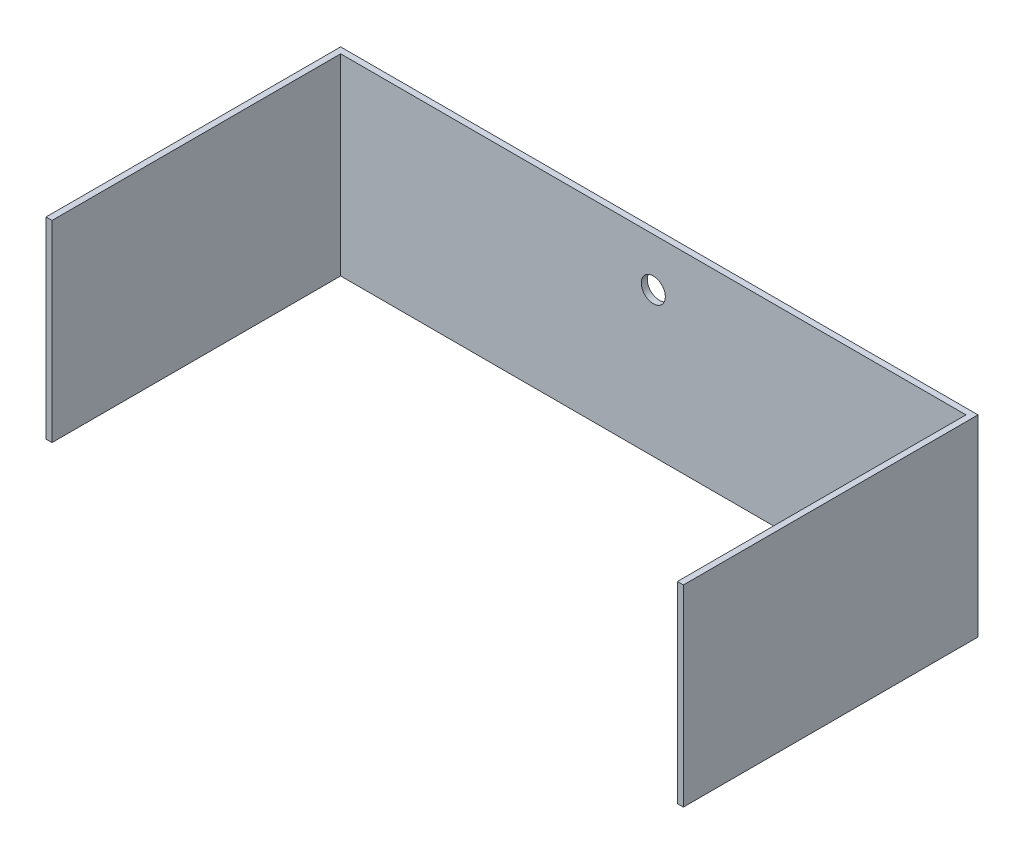
ISO-10303-21;
HEADER;
FILE_DESCRIPTION(('STEP AP214'),'2;1');
FILE_NAME('part.step','',(''),(''),'','','');
FILE_SCHEMA(('AUTOMOTIVE_DESIGN { 1 0 10303 214 1 1 1 1 }'));
ENDSEC;
DATA;
#1=APPLICATION_CONTEXT('core data for automotive mechanical design processes');
#2=APPLICATION_PROTOCOL_DEFINITION('international standard','automotive_design',2000,#1);
#3=PRODUCT_CONTEXT('',#1,'mechanical');
#4=PRODUCT('Part','Part','',(#3));
#5=PRODUCT_RELATED_PRODUCT_CATEGORY('part','',(#4));
#6=PRODUCT_DEFINITION_FORMATION('','',#4);
#7=PRODUCT_DEFINITION_CONTEXT('part definition',#1,'design');
#8=PRODUCT_DEFINITION('design','',#6,#7);
#9=PRODUCT_DEFINITION_SHAPE('','',#8);
#10=(LENGTH_UNIT() NAMED_UNIT(*) SI_UNIT(.MILLI.,.METRE.));
#11=(NAMED_UNIT(*) PLANE_ANGLE_UNIT() SI_UNIT($,.RADIAN.));
#12=(NAMED_UNIT(*) SI_UNIT($,.STERADIAN.) SOLID_ANGLE_UNIT());
#13=UNCERTAINTY_MEASURE_WITH_UNIT(LENGTH_MEASURE(1.E-05),#10,'distance_accuracy_value','');
#14=(GEOMETRIC_REPRESENTATION_CONTEXT(3) GLOBAL_UNCERTAINTY_ASSIGNED_CONTEXT((#13)) GLOBAL_UNIT_ASSIGNED_CONTEXT((#10,
#11,#12)) REPRESENTATION_CONTEXT('',''));
#15=CARTESIAN_POINT('',(0.,0.,0.));
#16=DIRECTION('',(0.,0.,1.));
#17=DIRECTION('',(1.,0.,0.));
#18=AXIS2_PLACEMENT_3D('',#15,#16,#17);
#19=CARTESIAN_POINT('',(0.,101.6,0.));
#20=DIRECTION('',(0.,0.,-1.));
#21=DIRECTION('',(-1.,0.,0.));
#22=AXIS2_PLACEMENT_3D('',#19,#20,#21);
#23=PLANE('',#22);
#24=DIRECTION('',(1.,0.,0.));
#25=VECTOR('',#24,1.);
#26=CARTESIAN_POINT('',(0.,0.,0.));
#27=LINE('',#26,#25);
#28=CARTESIAN_POINT('',(-3.175,0.,0.));
#29=VERTEX_POINT('',#28);
#30=CARTESIAN_POINT('',(0.,0.,0.));
#31=VERTEX_POINT('',#30);
#32=EDGE_CURVE('E128',#29,#31,#27,.T.);
#33=ORIENTED_EDGE('',*,*,#32,.T.);
#34=DIRECTION('',(0.,-1.,0.));
#35=VECTOR('',#34,1.);
#36=CARTESIAN_POINT('',(0.,101.6,0.));
#37=LINE('',#36,#35);
#38=CARTESIAN_POINT('',(0.,101.6,0.));
#39=VERTEX_POINT('',#38);
#40=EDGE_CURVE('E11',#39,#31,#37,.T.);
#41=ORIENTED_EDGE('',*,*,#40,.F.);
#42=DIRECTION('',(1.,0.,0.));
#43=VECTOR('',#42,1.);
#44=CARTESIAN_POINT('',(0.,101.6,0.));
#45=LINE('',#44,#43);
#46=CARTESIAN_POINT('',(-3.175,101.6,0.));
#47=VERTEX_POINT('',#46);
#48=EDGE_CURVE('E143',#47,#39,#45,.T.);
#49=ORIENTED_EDGE('',*,*,#48,.F.);
#50=DIRECTION('',(0.,-1.,0.));
#51=VECTOR('',#50,1.);
#52=CARTESIAN_POINT('',(-3.175,101.6,0.));
#53=LINE('',#52,#51);
#54=EDGE_CURVE('E124',#47,#29,#53,.T.);
#55=ORIENTED_EDGE('',*,*,#54,.T.);
#56=EDGE_LOOP('',(#33,#41,#49,#55));
#57=FACE_BOUND('',#56,.T.);
#58=ADVANCED_FACE('F32',(#57),#23,.F.);
#59=CARTESIAN_POINT('',(0.,101.6,0.));
#60=DIRECTION('',(-1.,0.,0.));
#61=DIRECTION('',(0.,0.,1.));
#62=AXIS2_PLACEMENT_3D('',#59,#60,#61);
#63=PLANE('',#62);
#64=DIRECTION('',(0.,0.,-1.));
#65=VECTOR('',#64,1.);
#66=CARTESIAN_POINT('',(0.,0.,0.));
#67=LINE('',#66,#65);
#68=CARTESIAN_POINT('',(0.,0.,-152.4));
#69=VERTEX_POINT('',#68);
#70=EDGE_CURVE('E131',#31,#69,#67,.T.);
#71=ORIENTED_EDGE('',*,*,#70,.T.);
#72=DIRECTION('',(0.,-1.,0.));
#73=VECTOR('',#72,1.);
#74=CARTESIAN_POINT('',(0.,101.6,-152.4));
#75=LINE('',#74,#73);
#76=CARTESIAN_POINT('',(0.,101.6,-152.4));
#77=VERTEX_POINT('',#76);
#78=EDGE_CURVE('E40',#77,#69,#75,.T.);
#79=ORIENTED_EDGE('',*,*,#78,.F.);
#80=DIRECTION('',(0.,0.,-1.));
#81=VECTOR('',#80,1.);
#82=CARTESIAN_POINT('',(0.,101.6,0.));
#83=LINE('',#82,#81);
#84=EDGE_CURVE('E91',#39,#77,#83,.T.);
#85=ORIENTED_EDGE('',*,*,#84,.F.);
#86=ORIENTED_EDGE('',*,*,#40,.T.);
#87=EDGE_LOOP('',(#71,#79,#85,#86));
#88=FACE_BOUND('',#87,.T.);
#89=ADVANCED_FACE('F195',(#88),#63,.F.);
#90=CARTESIAN_POINT('',(0.,101.6,-152.4));
#91=DIRECTION('',(0.,0.,-1.));
#92=DIRECTION('',(-1.,0.,0.));
#93=AXIS2_PLACEMENT_3D('',#90,#91,#92);
#94=PLANE('',#93);
#95=CARTESIAN_POINT('',(165.1,76.2,-152.4));
#96=DIRECTION('',(0.,0.,-1.));
#97=DIRECTION('',(-1.,0.,0.));
#98=AXIS2_PLACEMENT_3D('',#95,#96,#97);
#99=CIRCLE('',#98,6.35000000000002);
#100=CARTESIAN_POINT('',(158.75,76.2,-152.4));
#101=VERTEX_POINT('',#100);
#102=EDGE_CURVE('E132',#101,#101,#99,.F.);
#103=ORIENTED_EDGE('',*,*,#102,.F.);
#104=EDGE_LOOP('',(#103));
#105=FACE_BOUND('',#104,.T.);
#106=DIRECTION('',(1.,0.,0.));
#107=VECTOR('',#106,1.);
#108=CARTESIAN_POINT('',(0.,0.,-152.4));
#109=LINE('',#108,#107);
#110=CARTESIAN_POINT('',(330.2,0.,-152.4));
#111=VERTEX_POINT('',#110);
#112=EDGE_CURVE('E134',#69,#111,#109,.T.);
#113=ORIENTED_EDGE('',*,*,#112,.T.);
#114=DIRECTION('',(0.,-1.,0.));
#115=VECTOR('',#114,1.);
#116=CARTESIAN_POINT('',(330.2,101.6,-152.4));
#117=LINE('',#116,#115);
#118=CARTESIAN_POINT('',(330.2,101.6,-152.4));
#119=VERTEX_POINT('',#118);
#120=EDGE_CURVE('E150',#119,#111,#117,.T.);
#121=ORIENTED_EDGE('',*,*,#120,.F.);
#122=DIRECTION('',(1.,0.,0.));
#123=VECTOR('',#122,1.);
#124=CARTESIAN_POINT('',(0.,101.6,-152.4));
#125=LINE('',#124,#123);
#126=EDGE_CURVE('E158',#77,#119,#125,.T.);
#127=ORIENTED_EDGE('',*,*,#126,.F.);
#128=ORIENTED_EDGE('',*,*,#78,.T.);
#129=EDGE_LOOP('',(#113,#121,#127,#128));
#130=FACE_BOUND('',#129,.T.);
#131=ADVANCED_FACE('F156',(#105,#130),#94,.F.);
#132=CARTESIAN_POINT('',(330.2,101.6,-152.4));
#133=DIRECTION('',(1.,0.,0.));
#134=DIRECTION('',(0.,0.,-1.));
#135=AXIS2_PLACEMENT_3D('',#132,#133,#134);
#136=PLANE('',#135);
#137=DIRECTION('',(0.,0.,1.));
#138=VECTOR('',#137,1.);
#139=CARTESIAN_POINT('',(330.2,0.,-152.4));
#140=LINE('',#139,#138);
#141=CARTESIAN_POINT('',(330.2,0.,0.));
#142=VERTEX_POINT('',#141);
#143=EDGE_CURVE('E136',#111,#142,#140,.T.);
#144=ORIENTED_EDGE('',*,*,#143,.T.);
#145=DIRECTION('',(0.,-1.,0.));
#146=VECTOR('',#145,1.);
#147=CARTESIAN_POINT('',(330.2,101.6,0.));
#148=LINE('',#147,#146);
#149=CARTESIAN_POINT('',(330.2,101.6,0.));
#150=VERTEX_POINT('',#149);
#151=EDGE_CURVE('E147',#150,#142,#148,.T.);
#152=ORIENTED_EDGE('',*,*,#151,.F.);
#153=DIRECTION('',(0.,0.,1.));
#154=VECTOR('',#153,1.);
#155=CARTESIAN_POINT('',(330.2,101.6,-152.4));
#156=LINE('',#155,#154);
#157=EDGE_CURVE('E170',#119,#150,#156,.T.);
#158=ORIENTED_EDGE('',*,*,#157,.F.);
#159=ORIENTED_EDGE('',*,*,#120,.T.);
#160=EDGE_LOOP('',(#144,#152,#158,#159));
#161=FACE_BOUND('',#160,.T.);
#162=ADVANCED_FACE('F166',(#161),#136,.F.);
#163=CARTESIAN_POINT('',(330.2,101.6,0.));
#164=DIRECTION('',(0.,0.,-1.));
#165=DIRECTION('',(-1.,0.,0.));
#166=AXIS2_PLACEMENT_3D('',#163,#164,#165);
#167=PLANE('',#166);
#168=DIRECTION('',(1.,0.,0.));
#169=VECTOR('',#168,1.);
#170=CARTESIAN_POINT('',(330.2,0.,0.));
#171=LINE('',#170,#169);
#172=CARTESIAN_POINT('',(333.375,0.,0.));
#173=VERTEX_POINT('',#172);
#174=EDGE_CURVE('E138',#142,#173,#171,.T.);
#175=ORIENTED_EDGE('',*,*,#174,.T.);
#176=DIRECTION('',(0.,-1.,0.));
#177=VECTOR('',#176,1.);
#178=CARTESIAN_POINT('',(333.375,101.6,0.));
#179=LINE('',#178,#177);
#180=CARTESIAN_POINT('',(333.375,101.6,0.));
#181=VERTEX_POINT('',#180);
#182=EDGE_CURVE('E119',#181,#173,#179,.T.);
#183=ORIENTED_EDGE('',*,*,#182,.F.);
#184=DIRECTION('',(1.,0.,0.));
#185=VECTOR('',#184,1.);
#186=CARTESIAN_POINT('',(330.2,101.6,0.));
#187=LINE('',#186,#185);
#188=EDGE_CURVE('E110',#150,#181,#187,.T.);
#189=ORIENTED_EDGE('',*,*,#188,.F.);
#190=ORIENTED_EDGE('',*,*,#151,.T.);
#191=EDGE_LOOP('',(#175,#183,#189,#190));
#192=FACE_BOUND('',#191,.T.);
#193=ADVANCED_FACE('F169',(#192),#167,.F.);
#194=CARTESIAN_POINT('',(333.375,101.6,0.));
#195=DIRECTION('',(-1.,0.,0.));
#196=DIRECTION('',(0.,0.,1.));
#197=AXIS2_PLACEMENT_3D('',#194,#195,#196);
#198=PLANE('',#197);
#199=DIRECTION('',(0.,0.,-1.));
#200=VECTOR('',#199,1.);
#201=CARTESIAN_POINT('',(333.375,0.,0.));
#202=LINE('',#201,#200);
#203=CARTESIAN_POINT('',(333.375,0.,-155.575));
#204=VERTEX_POINT('',#203);
#205=EDGE_CURVE('E118',#173,#204,#202,.T.);
#206=ORIENTED_EDGE('',*,*,#205,.T.);
#207=DIRECTION('',(0.,-1.,0.));
#208=VECTOR('',#207,1.);
#209=CARTESIAN_POINT('',(333.375,101.6,-155.575));
#210=LINE('',#209,#208);
#211=CARTESIAN_POINT('',(333.375,101.6,-155.575));
#212=VERTEX_POINT('',#211);
#213=EDGE_CURVE('E115',#212,#204,#210,.T.);
#214=ORIENTED_EDGE('',*,*,#213,.F.);
#215=DIRECTION('',(0.,0.,-1.));
#216=VECTOR('',#215,1.);
#217=CARTESIAN_POINT('',(333.375,101.6,0.));
#218=LINE('',#217,#216);
#219=EDGE_CURVE('E104',#181,#212,#218,.T.);
#220=ORIENTED_EDGE('',*,*,#219,.F.);
#221=ORIENTED_EDGE('',*,*,#182,.T.);
#222=EDGE_LOOP('',(#206,#214,#220,#221));
#223=FACE_BOUND('',#222,.T.);
#224=ADVANCED_FACE('F116',(#223),#198,.F.);
#225=CARTESIAN_POINT('',(-3.175,101.6,-155.575));
#226=DIRECTION('',(0.,0.,1.));
#227=DIRECTION('',(1.,0.,0.));
#228=AXIS2_PLACEMENT_3D('',#225,#226,#227);
#229=PLANE('',#228);
#230=CARTESIAN_POINT('',(165.1,76.2,-155.575));
#231=DIRECTION('',(0.,0.,-1.));
#232=DIRECTION('',(-1.,0.,0.));
#233=AXIS2_PLACEMENT_3D('',#230,#231,#232);
#234=CIRCLE('',#233,6.35000000000002);
#235=CARTESIAN_POINT('',(158.75,76.2,-155.575));
#236=VERTEX_POINT('',#235);
#237=EDGE_CURVE('E178',#236,#236,#234,.T.);
#238=ORIENTED_EDGE('',*,*,#237,.F.);
#239=EDGE_LOOP('',(#238));
#240=FACE_BOUND('',#239,.T.);
#241=DIRECTION('',(-1.,0.,0.));
#242=VECTOR('',#241,1.);
#243=CARTESIAN_POINT('',(-3.175,0.,-155.575));
#244=LINE('',#243,#242);
#245=CARTESIAN_POINT('',(-3.175,0.,-155.575));
#246=VERTEX_POINT('',#245);
#247=EDGE_CURVE('E77',#204,#246,#244,.T.);
#248=ORIENTED_EDGE('',*,*,#247,.T.);
#249=DIRECTION('',(0.,-1.,0.));
#250=VECTOR('',#249,1.);
#251=CARTESIAN_POINT('',(-3.175,101.6,-155.575));
#252=LINE('',#251,#250);
#253=CARTESIAN_POINT('',(-3.175,101.6,-155.575));
#254=VERTEX_POINT('',#253);
#255=EDGE_CURVE('E120',#254,#246,#252,.T.);
#256=ORIENTED_EDGE('',*,*,#255,.F.);
#257=DIRECTION('',(-1.,0.,0.));
#258=VECTOR('',#257,1.);
#259=CARTESIAN_POINT('',(-3.175,101.6,-155.575));
#260=LINE('',#259,#258);
#261=EDGE_CURVE('E108',#212,#254,#260,.T.);
#262=ORIENTED_EDGE('',*,*,#261,.F.);
#263=ORIENTED_EDGE('',*,*,#213,.T.);
#264=EDGE_LOOP('',(#248,#256,#262,#263));
#265=FACE_BOUND('',#264,.T.);
#266=ADVANCED_FACE('F122',(#240,#265),#229,.F.);
#267=CARTESIAN_POINT('',(-3.175,101.6,0.));
#268=DIRECTION('',(1.,0.,0.));
#269=DIRECTION('',(0.,0.,-1.));
#270=AXIS2_PLACEMENT_3D('',#267,#268,#269);
#271=PLANE('',#270);
#272=DIRECTION('',(0.,0.,1.));
#273=VECTOR('',#272,1.);
#274=CARTESIAN_POINT('',(-3.175,0.,0.));
#275=LINE('',#274,#273);
#276=EDGE_CURVE('E83',#246,#29,#275,.T.);
#277=ORIENTED_EDGE('',*,*,#276,.T.);
#278=ORIENTED_EDGE('',*,*,#54,.F.);
#279=DIRECTION('',(0.,0.,1.));
#280=VECTOR('',#279,1.);
#281=CARTESIAN_POINT('',(-3.175,101.6,0.));
#282=LINE('',#281,#280);
#283=EDGE_CURVE('E48',#254,#47,#282,.T.);
#284=ORIENTED_EDGE('',*,*,#283,.F.);
#285=ORIENTED_EDGE('',*,*,#255,.T.);
#286=EDGE_LOOP('',(#277,#278,#284,#285));
#287=FACE_BOUND('',#286,.T.);
#288=ADVANCED_FACE('F186',(#287),#271,.F.);
#289=CARTESIAN_POINT('',(0.,101.6,0.));
#290=DIRECTION('',(0.,-1.,0.));
#291=DIRECTION('',(0.,0.,-1.));
#292=AXIS2_PLACEMENT_3D('',#289,#290,#291);
#293=PLANE('',#292);
#294=ORIENTED_EDGE('',*,*,#48,.T.);
#295=ORIENTED_EDGE('',*,*,#84,.T.);
#296=ORIENTED_EDGE('',*,*,#126,.T.);
#297=ORIENTED_EDGE('',*,*,#157,.T.);
#298=ORIENTED_EDGE('',*,*,#188,.T.);
#299=ORIENTED_EDGE('',*,*,#219,.T.);
#300=ORIENTED_EDGE('',*,*,#261,.T.);
#301=ORIENTED_EDGE('',*,*,#283,.T.);
#302=EDGE_LOOP('',(#294,#295,#296,#297,#298,#299,#300,#301));
#303=FACE_BOUND('',#302,.T.);
#304=ADVANCED_FACE('F106',(#303),#293,.F.);
#305=CARTESIAN_POINT('',(0.,0.,0.));
#306=DIRECTION('',(0.,-1.,0.));
#307=DIRECTION('',(0.,0.,-1.));
#308=AXIS2_PLACEMENT_3D('',#305,#306,#307);
#309=PLANE('',#308);
#310=ORIENTED_EDGE('',*,*,#32,.F.);
#311=ORIENTED_EDGE('',*,*,#276,.F.);
#312=ORIENTED_EDGE('',*,*,#247,.F.);
#313=ORIENTED_EDGE('',*,*,#205,.F.);
#314=ORIENTED_EDGE('',*,*,#174,.F.);
#315=ORIENTED_EDGE('',*,*,#143,.F.);
#316=ORIENTED_EDGE('',*,*,#112,.F.);
#317=ORIENTED_EDGE('',*,*,#70,.F.);
#318=EDGE_LOOP('',(#310,#311,#312,#313,#314,#315,#316,#317));
#319=FACE_BOUND('',#318,.T.);
#320=ADVANCED_FACE('F162',(#319),#309,.T.);
#321=CARTESIAN_POINT('',(165.1,76.2,0.001000000000001));
#322=DIRECTION('',(0.,0.,-1.));
#323=DIRECTION('',(-1.,0.,0.));
#324=AXIS2_PLACEMENT_3D('',#321,#322,#323);
#325=CYLINDRICAL_SURFACE('',#324,6.35000000000002);
#326=ORIENTED_EDGE('',*,*,#237,.T.);
#327=EDGE_LOOP('',(#326));
#328=FACE_BOUND('',#327,.T.);
#329=ORIENTED_EDGE('',*,*,#102,.T.);
#330=EDGE_LOOP('',(#329));
#331=FACE_BOUND('',#330,.T.);
#332=ADVANCED_FACE('F182',(#328,#331),#325,.F.);
#333=CLOSED_SHELL('',(#58,#89,#131,#162,#193,#224,#266,#288,#304,#320,#332));
#334=MANIFOLD_SOLID_BREP('B2',#333);
#335=ADVANCED_BREP_SHAPE_REPRESENTATION('',(#18,#334),#14);
#336=SHAPE_DEFINITION_REPRESENTATION(#9,#335);
ENDSEC;
END-ISO-10303-21;
